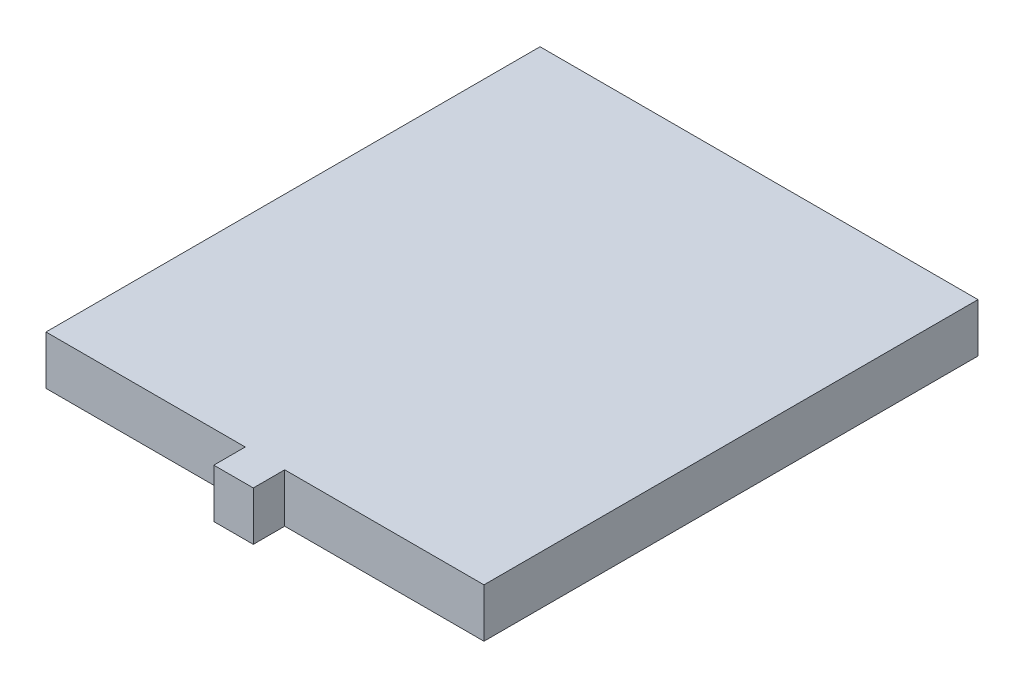
ISO-10303-21;
HEADER;
FILE_DESCRIPTION(('STEP AP214'),'2;1');
FILE_NAME('part.step','',(''),(''),'','','');
FILE_SCHEMA(('AUTOMOTIVE_DESIGN { 1 0 10303 214 1 1 1 1 }'));
ENDSEC;
DATA;
#1=APPLICATION_CONTEXT('core data for automotive mechanical design processes');
#2=APPLICATION_PROTOCOL_DEFINITION('international standard','automotive_design',2000,#1);
#3=PRODUCT_CONTEXT('',#1,'mechanical');
#4=PRODUCT('Part','Part','',(#3));
#5=PRODUCT_RELATED_PRODUCT_CATEGORY('part','',(#4));
#6=PRODUCT_DEFINITION_FORMATION('','',#4);
#7=PRODUCT_DEFINITION_CONTEXT('part definition',#1,'design');
#8=PRODUCT_DEFINITION('design','',#6,#7);
#9=PRODUCT_DEFINITION_SHAPE('','',#8);
#10=(LENGTH_UNIT() NAMED_UNIT(*) SI_UNIT(.MILLI.,.METRE.));
#11=(NAMED_UNIT(*) PLANE_ANGLE_UNIT() SI_UNIT($,.RADIAN.));
#12=(NAMED_UNIT(*) SI_UNIT($,.STERADIAN.) SOLID_ANGLE_UNIT());
#13=UNCERTAINTY_MEASURE_WITH_UNIT(LENGTH_MEASURE(1.E-05),#10,'distance_accuracy_value','');
#14=(GEOMETRIC_REPRESENTATION_CONTEXT(3) GLOBAL_UNCERTAINTY_ASSIGNED_CONTEXT((#13)) GLOBAL_UNIT_ASSIGNED_CONTEXT((#10,
#11,#12)) REPRESENTATION_CONTEXT('',''));
#15=CARTESIAN_POINT('',(0.,0.,0.));
#16=DIRECTION('',(0.,0.,1.));
#17=DIRECTION('',(1.,0.,0.));
#18=AXIS2_PLACEMENT_3D('',#15,#16,#17);
#19=CARTESIAN_POINT('',(-14.063742845291,5.8674,0.));
#20=DIRECTION('',(1.,0.,0.));
#21=DIRECTION('',(0.,0.,-1.));
#22=AXIS2_PLACEMENT_3D('',#19,#20,#21);
#23=PLANE('',#22);
#24=DIRECTION('',(0.,0.,1.));
#25=VECTOR('',#24,1.);
#26=CARTESIAN_POINT('',(-14.063742845291,0.,0.));
#27=LINE('',#26,#25);
#28=CARTESIAN_POINT('',(-14.063742845291,0.,32.6601555959003));
#29=VERTEX_POINT('',#28);
#30=CARTESIAN_POINT('',(-14.063742845291,0.,36.4333516343999));
#31=VERTEX_POINT('',#30);
#32=EDGE_CURVE('E130',#29,#31,#27,.T.);
#33=ORIENTED_EDGE('',*,*,#32,.F.);
#34=DIRECTION('',(0.,-1.,0.));
#35=VECTOR('',#34,1.);
#36=CARTESIAN_POINT('',(-14.063742845291,5.8674,32.6601555959003));
#37=LINE('',#36,#35);
#38=CARTESIAN_POINT('',(-14.063742845291,5.8674,32.6601555959003));
#39=VERTEX_POINT('',#38);
#40=EDGE_CURVE('E11',#39,#29,#37,.T.);
#41=ORIENTED_EDGE('',*,*,#40,.F.);
#42=DIRECTION('',(0.,0.,1.));
#43=VECTOR('',#42,1.);
#44=CARTESIAN_POINT('',(-14.063742845291,5.8674,0.));
#45=LINE('',#44,#43);
#46=CARTESIAN_POINT('',(-14.063742845291,5.8674,36.4333516343999));
#47=VERTEX_POINT('',#46);
#48=EDGE_CURVE('E147',#39,#47,#45,.T.);
#49=ORIENTED_EDGE('',*,*,#48,.T.);
#50=DIRECTION('',(0.,-1.,0.));
#51=VECTOR('',#50,1.);
#52=CARTESIAN_POINT('',(-14.063742845291,5.8674,36.4333516343999));
#53=LINE('',#52,#51);
#54=EDGE_CURVE('E86',#47,#31,#53,.T.);
#55=ORIENTED_EDGE('',*,*,#54,.T.);
#56=EDGE_LOOP('',(#33,#41,#49,#55));
#57=FACE_BOUND('',#56,.T.);
#58=ADVANCED_FACE('F35',(#57),#23,.T.);
#59=CARTESIAN_POINT('',(0.,5.8674,32.6601555959003));
#60=DIRECTION('',(0.,0.,-1.));
#61=DIRECTION('',(-1.,0.,0.));
#62=AXIS2_PLACEMENT_3D('',#59,#60,#61);
#63=PLANE('',#62);
#64=DIRECTION('',(1.,0.,0.));
#65=VECTOR('',#64,1.);
#66=CARTESIAN_POINT('',(0.,0.,32.6601555959003));
#67=LINE('',#66,#65);
#68=CARTESIAN_POINT('',(9.85498565293044,0.,32.6601555959003));
#69=VERTEX_POINT('',#68);
#70=EDGE_CURVE('E133',#29,#69,#67,.T.);
#71=ORIENTED_EDGE('',*,*,#70,.T.);
#72=DIRECTION('',(0.,-1.,0.));
#73=VECTOR('',#72,1.);
#74=CARTESIAN_POINT('',(9.85498565293044,5.8674,32.6601555959003));
#75=LINE('',#74,#73);
#76=CARTESIAN_POINT('',(9.85498565293044,5.8674,32.6601555959003));
#77=VERTEX_POINT('',#76);
#78=EDGE_CURVE('E43',#77,#69,#75,.T.);
#79=ORIENTED_EDGE('',*,*,#78,.F.);
#80=DIRECTION('',(1.,0.,0.));
#81=VECTOR('',#80,1.);
#82=CARTESIAN_POINT('',(0.,5.8674,32.6601555959003));
#83=LINE('',#82,#81);
#84=EDGE_CURVE('E116',#39,#77,#83,.T.);
#85=ORIENTED_EDGE('',*,*,#84,.F.);
#86=ORIENTED_EDGE('',*,*,#40,.T.);
#87=EDGE_LOOP('',(#71,#79,#85,#86));
#88=FACE_BOUND('',#87,.T.);
#89=ADVANCED_FACE('F174',(#88),#63,.F.);
#90=CARTESIAN_POINT('',(9.85498565293045,5.8674,0.));
#91=DIRECTION('',(-1.,0.,0.));
#92=DIRECTION('',(0.,0.,1.));
#93=AXIS2_PLACEMENT_3D('',#90,#91,#92);
#94=PLANE('',#93);
#95=DIRECTION('',(0.,0.,-1.));
#96=VECTOR('',#95,1.);
#97=CARTESIAN_POINT('',(9.85498565293045,0.,0.));
#98=LINE('',#97,#96);
#99=CARTESIAN_POINT('',(9.85498565293045,0.,-26.6488444040997));
#100=VERTEX_POINT('',#99);
#101=EDGE_CURVE('E135',#69,#100,#98,.T.);
#102=ORIENTED_EDGE('',*,*,#101,.T.);
#103=DIRECTION('',(0.,-1.,0.));
#104=VECTOR('',#103,1.);
#105=CARTESIAN_POINT('',(9.85498565293045,5.8674,-26.6488444040997));
#106=LINE('',#105,#104);
#107=CARTESIAN_POINT('',(9.85498565293045,5.8674,-26.6488444040997));
#108=VERTEX_POINT('',#107);
#109=EDGE_CURVE('E153',#108,#100,#106,.T.);
#110=ORIENTED_EDGE('',*,*,#109,.F.);
#111=DIRECTION('',(0.,0.,-1.));
#112=VECTOR('',#111,1.);
#113=CARTESIAN_POINT('',(9.85498565293045,5.8674,0.));
#114=LINE('',#113,#112);
#115=EDGE_CURVE('E161',#77,#108,#114,.T.);
#116=ORIENTED_EDGE('',*,*,#115,.F.);
#117=ORIENTED_EDGE('',*,*,#78,.T.);
#118=EDGE_LOOP('',(#102,#110,#116,#117));
#119=FACE_BOUND('',#118,.T.);
#120=ADVANCED_FACE('F159',(#119),#94,.F.);
#121=CARTESIAN_POINT('',(0.,5.8674,-26.6488444040997));
#122=DIRECTION('',(0.,0.,-1.));
#123=DIRECTION('',(-1.,0.,0.));
#124=AXIS2_PLACEMENT_3D('',#121,#122,#123);
#125=PLANE('',#124);
#126=DIRECTION('',(1.,0.,0.));
#127=VECTOR('',#126,1.);
#128=CARTESIAN_POINT('',(0.,0.,-26.6488444040997));
#129=LINE('',#128,#127);
#130=CARTESIAN_POINT('',(-42.7230143470695,0.,-26.6488444040997));
#131=VERTEX_POINT('',#130);
#132=EDGE_CURVE('E138',#131,#100,#129,.T.);
#133=ORIENTED_EDGE('',*,*,#132,.F.);
#134=DIRECTION('',(0.,-1.,0.));
#135=VECTOR('',#134,1.);
#136=CARTESIAN_POINT('',(-42.7230143470695,5.8674,-26.6488444040997));
#137=LINE('',#136,#135);
#138=CARTESIAN_POINT('',(-42.7230143470695,5.8674,-26.6488444040997));
#139=VERTEX_POINT('',#138);
#140=EDGE_CURVE('E151',#139,#131,#137,.T.);
#141=ORIENTED_EDGE('',*,*,#140,.F.);
#142=DIRECTION('',(1.,0.,0.));
#143=VECTOR('',#142,1.);
#144=CARTESIAN_POINT('',(0.,5.8674,-26.6488444040997));
#145=LINE('',#144,#143);
#146=EDGE_CURVE('E171',#139,#108,#145,.T.);
#147=ORIENTED_EDGE('',*,*,#146,.T.);
#148=ORIENTED_EDGE('',*,*,#109,.T.);
#149=EDGE_LOOP('',(#133,#141,#147,#148));
#150=FACE_BOUND('',#149,.T.);
#151=ADVANCED_FACE('F169',(#150),#125,.T.);
#152=CARTESIAN_POINT('',(-42.7230143470695,5.8674,0.));
#153=DIRECTION('',(-1.,0.,0.));
#154=DIRECTION('',(0.,0.,1.));
#155=AXIS2_PLACEMENT_3D('',#152,#153,#154);
#156=PLANE('',#155);
#157=DIRECTION('',(0.,0.,-1.));
#158=VECTOR('',#157,1.);
#159=CARTESIAN_POINT('',(-42.7230143470695,0.,0.));
#160=LINE('',#159,#158);
#161=CARTESIAN_POINT('',(-42.7230143470695,0.,32.6601555959003));
#162=VERTEX_POINT('',#161);
#163=EDGE_CURVE('E141',#162,#131,#160,.T.);
#164=ORIENTED_EDGE('',*,*,#163,.F.);
#165=DIRECTION('',(0.,-1.,0.));
#166=VECTOR('',#165,1.);
#167=CARTESIAN_POINT('',(-42.7230143470695,5.8674,32.6601555959003));
#168=LINE('',#167,#166);
#169=CARTESIAN_POINT('',(-42.7230143470695,5.8674,32.6601555959003));
#170=VERTEX_POINT('',#169);
#171=EDGE_CURVE('E121',#170,#162,#168,.T.);
#172=ORIENTED_EDGE('',*,*,#171,.F.);
#173=DIRECTION('',(0.,0.,-1.));
#174=VECTOR('',#173,1.);
#175=CARTESIAN_POINT('',(-42.7230143470695,5.8674,0.));
#176=LINE('',#175,#174);
#177=EDGE_CURVE('E113',#170,#139,#176,.T.);
#178=ORIENTED_EDGE('',*,*,#177,.T.);
#179=ORIENTED_EDGE('',*,*,#140,.T.);
#180=EDGE_LOOP('',(#164,#172,#178,#179));
#181=FACE_BOUND('',#180,.T.);
#182=ADVANCED_FACE('F184',(#181),#156,.T.);
#183=CARTESIAN_POINT('',(-18.8042858488481,0.,32.6601555959003));
#184=VERTEX_POINT('',#183);
#185=EDGE_CURVE('E120',#162,#184,#67,.T.);
#186=ORIENTED_EDGE('',*,*,#185,.T.);
#187=DIRECTION('',(0.,-1.,0.));
#188=VECTOR('',#187,1.);
#189=CARTESIAN_POINT('',(-18.8042858488481,5.8674,32.6601555959003));
#190=LINE('',#189,#188);
#191=CARTESIAN_POINT('',(-18.8042858488481,5.8674,32.6601555959003));
#192=VERTEX_POINT('',#191);
#193=EDGE_CURVE('E117',#192,#184,#190,.T.);
#194=ORIENTED_EDGE('',*,*,#193,.F.);
#195=EDGE_CURVE('E106',#170,#192,#83,.T.);
#196=ORIENTED_EDGE('',*,*,#195,.F.);
#197=ORIENTED_EDGE('',*,*,#171,.T.);
#198=EDGE_LOOP('',(#186,#194,#196,#197));
#199=FACE_BOUND('',#198,.T.);
#200=ADVANCED_FACE('F118',(#199),#63,.F.);
#201=CARTESIAN_POINT('',(-18.8042858488481,5.8674,0.));
#202=DIRECTION('',(1.,0.,0.));
#203=DIRECTION('',(0.,0.,-1.));
#204=AXIS2_PLACEMENT_3D('',#201,#202,#203);
#205=PLANE('',#204);
#206=DIRECTION('',(0.,0.,1.));
#207=VECTOR('',#206,1.);
#208=CARTESIAN_POINT('',(-18.8042858488481,0.,0.));
#209=LINE('',#208,#207);
#210=CARTESIAN_POINT('',(-18.8042858488481,0.,36.4333516343999));
#211=VERTEX_POINT('',#210);
#212=EDGE_CURVE('E79',#184,#211,#209,.T.);
#213=ORIENTED_EDGE('',*,*,#212,.T.);
#214=DIRECTION('',(0.,-1.,0.));
#215=VECTOR('',#214,1.);
#216=CARTESIAN_POINT('',(-18.8042858488481,5.8674,36.4333516343999));
#217=LINE('',#216,#215);
#218=CARTESIAN_POINT('',(-18.8042858488481,5.8674,36.4333516343999));
#219=VERTEX_POINT('',#218);
#220=EDGE_CURVE('E122',#219,#211,#217,.T.);
#221=ORIENTED_EDGE('',*,*,#220,.F.);
#222=DIRECTION('',(0.,0.,1.));
#223=VECTOR('',#222,1.);
#224=CARTESIAN_POINT('',(-18.8042858488481,5.8674,0.));
#225=LINE('',#224,#223);
#226=EDGE_CURVE('E110',#192,#219,#225,.T.);
#227=ORIENTED_EDGE('',*,*,#226,.F.);
#228=ORIENTED_EDGE('',*,*,#193,.T.);
#229=EDGE_LOOP('',(#213,#221,#227,#228));
#230=FACE_BOUND('',#229,.T.);
#231=ADVANCED_FACE('F124',(#230),#205,.F.);
#232=CARTESIAN_POINT('',(0.,5.8674,36.4333516343999));
#233=DIRECTION('',(0.,0.,-1.));
#234=DIRECTION('',(-1.,0.,0.));
#235=AXIS2_PLACEMENT_3D('',#232,#233,#234);
#236=PLANE('',#235);
#237=DIRECTION('',(1.,0.,0.));
#238=VECTOR('',#237,1.);
#239=CARTESIAN_POINT('',(0.,0.,36.4333516343999));
#240=LINE('',#239,#238);
#241=EDGE_CURVE('E145',#211,#31,#240,.T.);
#242=ORIENTED_EDGE('',*,*,#241,.T.);
#243=ORIENTED_EDGE('',*,*,#54,.F.);
#244=DIRECTION('',(1.,0.,0.));
#245=VECTOR('',#244,1.);
#246=CARTESIAN_POINT('',(0.,5.8674,36.4333516343999));
#247=LINE('',#246,#245);
#248=EDGE_CURVE('E51',#219,#47,#247,.T.);
#249=ORIENTED_EDGE('',*,*,#248,.F.);
#250=ORIENTED_EDGE('',*,*,#220,.T.);
#251=EDGE_LOOP('',(#242,#243,#249,#250));
#252=FACE_BOUND('',#251,.T.);
#253=ADVANCED_FACE('F189',(#252),#236,.F.);
#254=CARTESIAN_POINT('',(0.,5.8674,0.));
#255=DIRECTION('',(0.,1.,0.));
#256=DIRECTION('',(0.,0.,1.));
#257=AXIS2_PLACEMENT_3D('',#254,#255,#256);
#258=PLANE('',#257);
#259=ORIENTED_EDGE('',*,*,#48,.F.);
#260=ORIENTED_EDGE('',*,*,#84,.T.);
#261=ORIENTED_EDGE('',*,*,#115,.T.);
#262=ORIENTED_EDGE('',*,*,#146,.F.);
#263=ORIENTED_EDGE('',*,*,#177,.F.);
#264=ORIENTED_EDGE('',*,*,#195,.T.);
#265=ORIENTED_EDGE('',*,*,#226,.T.);
#266=ORIENTED_EDGE('',*,*,#248,.T.);
#267=EDGE_LOOP('',(#259,#260,#261,#262,#263,#264,#265,#266));
#268=FACE_BOUND('',#267,.T.);
#269=ADVANCED_FACE('F108',(#268),#258,.T.);
#270=CARTESIAN_POINT('',(0.,0.,0.));
#271=DIRECTION('',(0.,1.,0.));
#272=DIRECTION('',(0.,0.,1.));
#273=AXIS2_PLACEMENT_3D('',#270,#271,#272);
#274=PLANE('',#273);
#275=ORIENTED_EDGE('',*,*,#32,.T.);
#276=ORIENTED_EDGE('',*,*,#241,.F.);
#277=ORIENTED_EDGE('',*,*,#212,.F.);
#278=ORIENTED_EDGE('',*,*,#185,.F.);
#279=ORIENTED_EDGE('',*,*,#163,.T.);
#280=ORIENTED_EDGE('',*,*,#132,.T.);
#281=ORIENTED_EDGE('',*,*,#101,.F.);
#282=ORIENTED_EDGE('',*,*,#70,.F.);
#283=EDGE_LOOP('',(#275,#276,#277,#278,#279,#280,#281,#282));
#284=FACE_BOUND('',#283,.T.);
#285=ADVANCED_FACE('F165',(#284),#274,.F.);
#286=CLOSED_SHELL('',(#58,#89,#120,#151,#182,#200,#231,#253,#269,#285));
#287=MANIFOLD_SOLID_BREP('B2',#286);
#288=ADVANCED_BREP_SHAPE_REPRESENTATION('',(#18,#287),#14);
#289=SHAPE_DEFINITION_REPRESENTATION(#9,#288);
ENDSEC;
END-ISO-10303-21;
